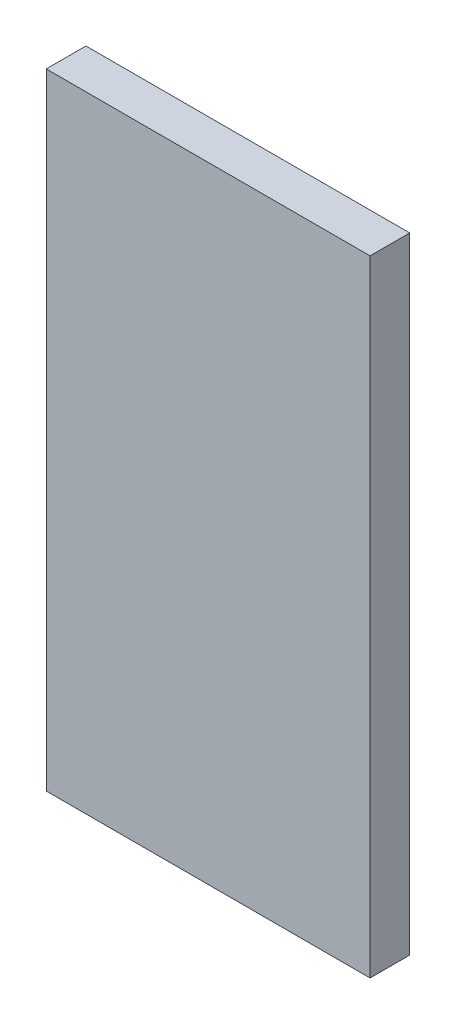
ISO-10303-21;
HEADER;
FILE_DESCRIPTION(('STEP AP214'),'2;1');
FILE_NAME('part.step','',(''),(''),'','','');
FILE_SCHEMA(('AUTOMOTIVE_DESIGN { 1 0 10303 214 1 1 1 1 }'));
ENDSEC;
DATA;
#1=APPLICATION_CONTEXT('core data for automotive mechanical design processes');
#2=APPLICATION_PROTOCOL_DEFINITION('international standard','automotive_design',2000,#1);
#3=PRODUCT_CONTEXT('',#1,'mechanical');
#4=PRODUCT('Part','Part','',(#3));
#5=PRODUCT_RELATED_PRODUCT_CATEGORY('part','',(#4));
#6=PRODUCT_DEFINITION_FORMATION('','',#4);
#7=PRODUCT_DEFINITION_CONTEXT('part definition',#1,'design');
#8=PRODUCT_DEFINITION('design','',#6,#7);
#9=PRODUCT_DEFINITION_SHAPE('','',#8);
#10=(LENGTH_UNIT() NAMED_UNIT(*) SI_UNIT(.MILLI.,.METRE.));
#11=(NAMED_UNIT(*) PLANE_ANGLE_UNIT() SI_UNIT($,.RADIAN.));
#12=(NAMED_UNIT(*) SI_UNIT($,.STERADIAN.) SOLID_ANGLE_UNIT());
#13=UNCERTAINTY_MEASURE_WITH_UNIT(LENGTH_MEASURE(1.E-05),#10,'distance_accuracy_value','');
#14=(GEOMETRIC_REPRESENTATION_CONTEXT(3) GLOBAL_UNCERTAINTY_ASSIGNED_CONTEXT((#13)) GLOBAL_UNIT_ASSIGNED_CONTEXT((#10,
#11,#12)) REPRESENTATION_CONTEXT('',''));
#15=CARTESIAN_POINT('',(0.,0.,0.));
#16=DIRECTION('',(0.,0.,1.));
#17=DIRECTION('',(1.,0.,0.));
#18=AXIS2_PLACEMENT_3D('',#15,#16,#17);
#19=CARTESIAN_POINT('',(7.212,2.122,0.1));
#20=DIRECTION('',(0.,0.,1.));
#21=DIRECTION('',(1.,0.,0.));
#22=AXIS2_PLACEMENT_3D('',#19,#20,#21);
#23=PLANE('',#22);
#24=DIRECTION('',(0.,1.,0.));
#25=VECTOR('',#24,1.);
#26=CARTESIAN_POINT('',(8.028,2.122,0.1));
#27=LINE('',#26,#25);
#28=CARTESIAN_POINT('',(8.028,3.698,0.1));
#29=VERTEX_POINT('',#28);
#30=CARTESIAN_POINT('',(8.028,2.122,0.1));
#31=VERTEX_POINT('',#30);
#32=EDGE_CURVE('E75',#29,#31,#27,.F.);
#33=ORIENTED_EDGE('',*,*,#32,.F.);
#34=DIRECTION('',(1.,0.,0.));
#35=VECTOR('',#34,1.);
#36=CARTESIAN_POINT('',(7.212,3.698,0.1));
#37=LINE('',#36,#35);
#38=CARTESIAN_POINT('',(7.212,3.698,0.1));
#39=VERTEX_POINT('',#38);
#40=EDGE_CURVE('E57',#39,#29,#37,.T.);
#41=ORIENTED_EDGE('',*,*,#40,.F.);
#42=DIRECTION('',(0.,1.,0.));
#43=VECTOR('',#42,1.);
#44=CARTESIAN_POINT('',(7.212,2.122,0.1));
#45=LINE('',#44,#43);
#46=CARTESIAN_POINT('',(7.212,2.122,0.1));
#47=VERTEX_POINT('',#46);
#48=EDGE_CURVE('E19',#39,#47,#45,.F.);
#49=ORIENTED_EDGE('',*,*,#48,.T.);
#50=DIRECTION('',(1.,0.,0.));
#51=VECTOR('',#50,1.);
#52=CARTESIAN_POINT('',(7.212,2.122,0.1));
#53=LINE('',#52,#51);
#54=EDGE_CURVE('E54',#47,#31,#53,.T.);
#55=ORIENTED_EDGE('',*,*,#54,.T.);
#56=EDGE_LOOP('',(#33,#41,#49,#55));
#57=FACE_BOUND('',#56,.T.);
#58=ADVANCED_FACE('F16',(#57),#23,.T.);
#59=CARTESIAN_POINT('',(7.212,2.122,0.));
#60=DIRECTION('',(1.,0.,0.));
#61=DIRECTION('',(0.,0.,-1.));
#62=AXIS2_PLACEMENT_3D('',#59,#60,#61);
#63=PLANE('',#62);
#64=DIRECTION('',(0.,0.,1.));
#65=VECTOR('',#64,1.);
#66=CARTESIAN_POINT('',(7.212,3.698,0.));
#67=LINE('',#66,#65);
#68=CARTESIAN_POINT('',(7.212,3.698,0.));
#69=VERTEX_POINT('',#68);
#70=EDGE_CURVE('E77',#69,#39,#67,.T.);
#71=ORIENTED_EDGE('',*,*,#70,.F.);
#72=DIRECTION('',(0.,1.,0.));
#73=VECTOR('',#72,1.);
#74=CARTESIAN_POINT('',(7.212,2.122,0.));
#75=LINE('',#74,#73);
#76=CARTESIAN_POINT('',(7.212,2.122,0.));
#77=VERTEX_POINT('',#76);
#78=EDGE_CURVE('E72',#69,#77,#75,.F.);
#79=ORIENTED_EDGE('',*,*,#78,.T.);
#80=DIRECTION('',(0.,0.,1.));
#81=VECTOR('',#80,1.);
#82=CARTESIAN_POINT('',(7.212,2.122,0.));
#83=LINE('',#82,#81);
#84=EDGE_CURVE('E62',#77,#47,#83,.T.);
#85=ORIENTED_EDGE('',*,*,#84,.T.);
#86=ORIENTED_EDGE('',*,*,#48,.F.);
#87=EDGE_LOOP('',(#71,#79,#85,#86));
#88=FACE_BOUND('',#87,.T.);
#89=ADVANCED_FACE('F71',(#88),#63,.F.);
#90=CARTESIAN_POINT('',(7.212,2.122,0.));
#91=DIRECTION('',(0.,1.,0.));
#92=DIRECTION('',(0.,0.,1.));
#93=AXIS2_PLACEMENT_3D('',#90,#91,#92);
#94=PLANE('',#93);
#95=ORIENTED_EDGE('',*,*,#54,.F.);
#96=ORIENTED_EDGE('',*,*,#84,.F.);
#97=DIRECTION('',(1.,0.,0.));
#98=VECTOR('',#97,1.);
#99=CARTESIAN_POINT('',(7.212,2.122,0.));
#100=LINE('',#99,#98);
#101=CARTESIAN_POINT('',(8.028,2.122,0.));
#102=VERTEX_POINT('',#101);
#103=EDGE_CURVE('E82',#77,#102,#100,.T.);
#104=ORIENTED_EDGE('',*,*,#103,.T.);
#105=DIRECTION('',(0.,0.,-1.));
#106=VECTOR('',#105,1.);
#107=CARTESIAN_POINT('',(8.028,2.122,0.));
#108=LINE('',#107,#106);
#109=EDGE_CURVE('E68',#31,#102,#108,.T.);
#110=ORIENTED_EDGE('',*,*,#109,.F.);
#111=EDGE_LOOP('',(#95,#96,#104,#110));
#112=FACE_BOUND('',#111,.T.);
#113=ADVANCED_FACE('F65',(#112),#94,.F.);
#114=CARTESIAN_POINT('',(8.028,2.122,0.));
#115=DIRECTION('',(1.,0.,0.));
#116=DIRECTION('',(0.,0.,-1.));
#117=AXIS2_PLACEMENT_3D('',#114,#115,#116);
#118=PLANE('',#117);
#119=DIRECTION('',(0.,0.,1.));
#120=VECTOR('',#119,1.);
#121=CARTESIAN_POINT('',(8.028,3.698,0.));
#122=LINE('',#121,#120);
#123=CARTESIAN_POINT('',(8.028,3.698,0.));
#124=VERTEX_POINT('',#123);
#125=EDGE_CURVE('E33',#29,#124,#122,.F.);
#126=ORIENTED_EDGE('',*,*,#125,.F.);
#127=ORIENTED_EDGE('',*,*,#32,.T.);
#128=ORIENTED_EDGE('',*,*,#109,.T.);
#129=DIRECTION('',(0.,1.,0.));
#130=VECTOR('',#129,1.);
#131=CARTESIAN_POINT('',(8.028,2.122,0.));
#132=LINE('',#131,#130);
#133=EDGE_CURVE('E25',#102,#124,#132,.T.);
#134=ORIENTED_EDGE('',*,*,#133,.T.);
#135=EDGE_LOOP('',(#126,#127,#128,#134));
#136=FACE_BOUND('',#135,.T.);
#137=ADVANCED_FACE('F87',(#136),#118,.T.);
#138=CARTESIAN_POINT('',(7.212,3.698,0.));
#139=DIRECTION('',(0.,1.,0.));
#140=DIRECTION('',(0.,0.,1.));
#141=AXIS2_PLACEMENT_3D('',#138,#139,#140);
#142=PLANE('',#141);
#143=ORIENTED_EDGE('',*,*,#40,.T.);
#144=ORIENTED_EDGE('',*,*,#125,.T.);
#145=DIRECTION('',(1.,0.,0.));
#146=VECTOR('',#145,1.);
#147=CARTESIAN_POINT('',(7.212,3.698,0.));
#148=LINE('',#147,#146);
#149=EDGE_CURVE('E11',#124,#69,#148,.F.);
#150=ORIENTED_EDGE('',*,*,#149,.T.);
#151=ORIENTED_EDGE('',*,*,#70,.T.);
#152=EDGE_LOOP('',(#143,#144,#150,#151));
#153=FACE_BOUND('',#152,.T.);
#154=ADVANCED_FACE('F90',(#153),#142,.T.);
#155=CARTESIAN_POINT('',(7.212,2.122,0.));
#156=DIRECTION('',(0.,0.,1.));
#157=DIRECTION('',(1.,0.,0.));
#158=AXIS2_PLACEMENT_3D('',#155,#156,#157);
#159=PLANE('',#158);
#160=ORIENTED_EDGE('',*,*,#133,.F.);
#161=ORIENTED_EDGE('',*,*,#103,.F.);
#162=ORIENTED_EDGE('',*,*,#78,.F.);
#163=ORIENTED_EDGE('',*,*,#149,.F.);
#164=EDGE_LOOP('',(#160,#161,#162,#163));
#165=FACE_BOUND('',#164,.T.);
#166=ADVANCED_FACE('F89',(#165),#159,.F.);
#167=CLOSED_SHELL('',(#58,#89,#113,#137,#154,#166));
#168=MANIFOLD_SOLID_BREP('B1',#167);
#169=ADVANCED_BREP_SHAPE_REPRESENTATION('',(#18,#168),#14);
#170=SHAPE_DEFINITION_REPRESENTATION(#9,#169);
ENDSEC;
END-ISO-10303-21;
